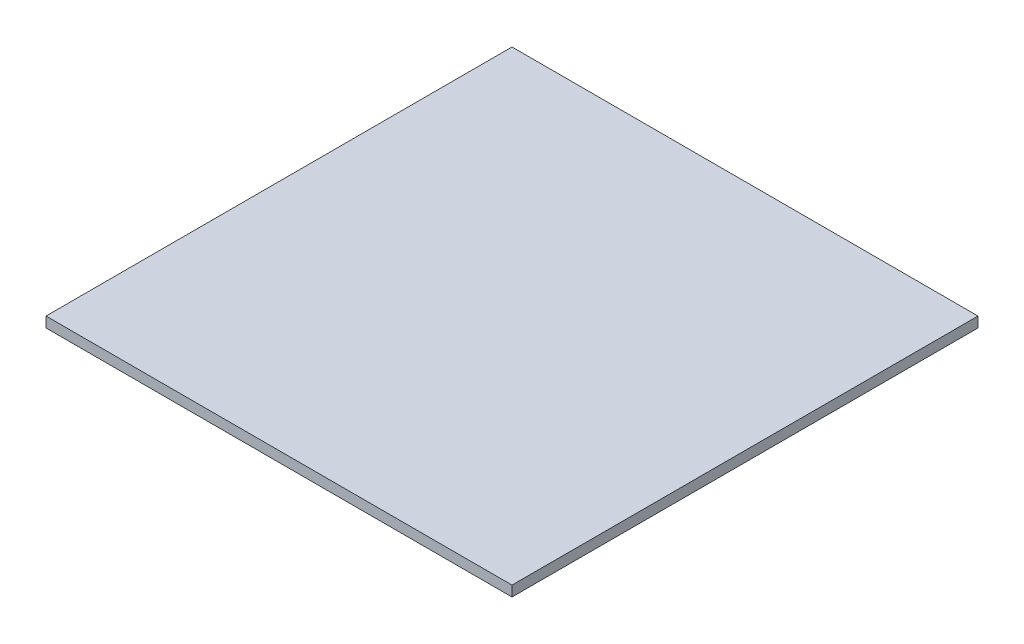
ISO-10303-21;
HEADER;
FILE_DESCRIPTION(('STEP AP214'),'2;1');
FILE_NAME('part.step','',(''),(''),'','','');
FILE_SCHEMA(('AUTOMOTIVE_DESIGN { 1 0 10303 214 1 1 1 1 }'));
ENDSEC;
DATA;
#1=APPLICATION_CONTEXT('core data for automotive mechanical design processes');
#2=APPLICATION_PROTOCOL_DEFINITION('international standard','automotive_design',2000,#1);
#3=PRODUCT_CONTEXT('',#1,'mechanical');
#4=PRODUCT('Part','Part','',(#3));
#5=PRODUCT_RELATED_PRODUCT_CATEGORY('part','',(#4));
#6=PRODUCT_DEFINITION_FORMATION('','',#4);
#7=PRODUCT_DEFINITION_CONTEXT('part definition',#1,'design');
#8=PRODUCT_DEFINITION('design','',#6,#7);
#9=PRODUCT_DEFINITION_SHAPE('','',#8);
#10=(LENGTH_UNIT() NAMED_UNIT(*) SI_UNIT(.MILLI.,.METRE.));
#11=(NAMED_UNIT(*) PLANE_ANGLE_UNIT() SI_UNIT($,.RADIAN.));
#12=(NAMED_UNIT(*) SI_UNIT($,.STERADIAN.) SOLID_ANGLE_UNIT());
#13=UNCERTAINTY_MEASURE_WITH_UNIT(LENGTH_MEASURE(1.E-05),#10,'distance_accuracy_value','');
#14=(GEOMETRIC_REPRESENTATION_CONTEXT(3) GLOBAL_UNCERTAINTY_ASSIGNED_CONTEXT((#13)) GLOBAL_UNIT_ASSIGNED_CONTEXT((#10,
#11,#12)) REPRESENTATION_CONTEXT('',''));
#15=CARTESIAN_POINT('',(0.,0.,0.));
#16=DIRECTION('',(0.,0.,1.));
#17=DIRECTION('',(1.,0.,0.));
#18=AXIS2_PLACEMENT_3D('',#15,#16,#17);
#19=CARTESIAN_POINT('',(225.,10.,225.));
#20=DIRECTION('',(-1.,0.,0.));
#21=DIRECTION('',(0.,0.,1.));
#22=AXIS2_PLACEMENT_3D('',#19,#20,#21);
#23=PLANE('',#22);
#24=DIRECTION('',(0.,0.,-1.));
#25=VECTOR('',#24,1.);
#26=CARTESIAN_POINT('',(225.,0.,225.));
#27=LINE('',#26,#25);
#28=CARTESIAN_POINT('',(225.,0.,225.));
#29=VERTEX_POINT('',#28);
#30=CARTESIAN_POINT('',(225.,0.,-225.));
#31=VERTEX_POINT('',#30);
#32=EDGE_CURVE('E107',#29,#31,#27,.T.);
#33=ORIENTED_EDGE('',*,*,#32,.T.);
#34=DIRECTION('',(0.,-1.,0.));
#35=VECTOR('',#34,1.);
#36=CARTESIAN_POINT('',(225.,10.,-225.));
#37=LINE('',#36,#35);
#38=CARTESIAN_POINT('',(225.,10.,-225.));
#39=VERTEX_POINT('',#38);
#40=EDGE_CURVE('E11',#39,#31,#37,.T.);
#41=ORIENTED_EDGE('',*,*,#40,.F.);
#42=DIRECTION('',(0.,0.,-1.));
#43=VECTOR('',#42,1.);
#44=CARTESIAN_POINT('',(225.,10.,225.));
#45=LINE('',#44,#43);
#46=CARTESIAN_POINT('',(225.,10.,225.));
#47=VERTEX_POINT('',#46);
#48=EDGE_CURVE('E91',#47,#39,#45,.T.);
#49=ORIENTED_EDGE('',*,*,#48,.F.);
#50=DIRECTION('',(0.,-1.,0.));
#51=VECTOR('',#50,1.);
#52=CARTESIAN_POINT('',(225.,10.,225.));
#53=LINE('',#52,#51);
#54=EDGE_CURVE('E103',#47,#29,#53,.T.);
#55=ORIENTED_EDGE('',*,*,#54,.T.);
#56=EDGE_LOOP('',(#33,#41,#49,#55));
#57=FACE_BOUND('',#56,.T.);
#58=ADVANCED_FACE('F39',(#57),#23,.F.);
#59=CARTESIAN_POINT('',(-225.,10.,-225.));
#60=DIRECTION('',(0.,0.,1.));
#61=DIRECTION('',(1.,0.,0.));
#62=AXIS2_PLACEMENT_3D('',#59,#60,#61);
#63=PLANE('',#62);
#64=DIRECTION('',(-1.,0.,0.));
#65=VECTOR('',#64,1.);
#66=CARTESIAN_POINT('',(-225.,0.,-225.));
#67=LINE('',#66,#65);
#68=CARTESIAN_POINT('',(-225.,0.,-225.));
#69=VERTEX_POINT('',#68);
#70=EDGE_CURVE('E96',#31,#69,#67,.T.);
#71=ORIENTED_EDGE('',*,*,#70,.T.);
#72=DIRECTION('',(0.,-1.,0.));
#73=VECTOR('',#72,1.);
#74=CARTESIAN_POINT('',(-225.,10.,-225.));
#75=LINE('',#74,#73);
#76=CARTESIAN_POINT('',(-225.,10.,-225.));
#77=VERTEX_POINT('',#76);
#78=EDGE_CURVE('E48',#77,#69,#75,.T.);
#79=ORIENTED_EDGE('',*,*,#78,.F.);
#80=DIRECTION('',(-1.,0.,0.));
#81=VECTOR('',#80,1.);
#82=CARTESIAN_POINT('',(-225.,10.,-225.));
#83=LINE('',#82,#81);
#84=EDGE_CURVE('E86',#39,#77,#83,.T.);
#85=ORIENTED_EDGE('',*,*,#84,.F.);
#86=ORIENTED_EDGE('',*,*,#40,.T.);
#87=EDGE_LOOP('',(#71,#79,#85,#86));
#88=FACE_BOUND('',#87,.T.);
#89=ADVANCED_FACE('F95',(#88),#63,.F.);
#90=CARTESIAN_POINT('',(-225.,10.,225.));
#91=DIRECTION('',(1.,0.,0.));
#92=DIRECTION('',(0.,0.,-1.));
#93=AXIS2_PLACEMENT_3D('',#90,#91,#92);
#94=PLANE('',#93);
#95=DIRECTION('',(0.,0.,1.));
#96=VECTOR('',#95,1.);
#97=CARTESIAN_POINT('',(-225.,0.,225.));
#98=LINE('',#97,#96);
#99=CARTESIAN_POINT('',(-225.,0.,225.));
#100=VERTEX_POINT('',#99);
#101=EDGE_CURVE('E73',#69,#100,#98,.T.);
#102=ORIENTED_EDGE('',*,*,#101,.T.);
#103=DIRECTION('',(0.,-1.,0.));
#104=VECTOR('',#103,1.);
#105=CARTESIAN_POINT('',(-225.,10.,225.));
#106=LINE('',#105,#104);
#107=CARTESIAN_POINT('',(-225.,10.,225.));
#108=VERTEX_POINT('',#107);
#109=EDGE_CURVE('E98',#108,#100,#106,.T.);
#110=ORIENTED_EDGE('',*,*,#109,.F.);
#111=DIRECTION('',(0.,0.,1.));
#112=VECTOR('',#111,1.);
#113=CARTESIAN_POINT('',(-225.,10.,225.));
#114=LINE('',#113,#112);
#115=EDGE_CURVE('E89',#77,#108,#114,.T.);
#116=ORIENTED_EDGE('',*,*,#115,.F.);
#117=ORIENTED_EDGE('',*,*,#78,.T.);
#118=EDGE_LOOP('',(#102,#110,#116,#117));
#119=FACE_BOUND('',#118,.T.);
#120=ADVANCED_FACE('F99',(#119),#94,.F.);
#121=CARTESIAN_POINT('',(-225.,10.,225.));
#122=DIRECTION('',(0.,0.,-1.));
#123=DIRECTION('',(-1.,0.,0.));
#124=AXIS2_PLACEMENT_3D('',#121,#122,#123);
#125=PLANE('',#124);
#126=DIRECTION('',(1.,0.,0.));
#127=VECTOR('',#126,1.);
#128=CARTESIAN_POINT('',(-225.,0.,225.));
#129=LINE('',#128,#127);
#130=EDGE_CURVE('E79',#100,#29,#129,.T.);
#131=ORIENTED_EDGE('',*,*,#130,.T.);
#132=ORIENTED_EDGE('',*,*,#54,.F.);
#133=DIRECTION('',(1.,0.,0.));
#134=VECTOR('',#133,1.);
#135=CARTESIAN_POINT('',(-225.,10.,225.));
#136=LINE('',#135,#134);
#137=EDGE_CURVE('E56',#108,#47,#136,.T.);
#138=ORIENTED_EDGE('',*,*,#137,.F.);
#139=ORIENTED_EDGE('',*,*,#109,.T.);
#140=EDGE_LOOP('',(#131,#132,#138,#139));
#141=FACE_BOUND('',#140,.T.);
#142=ADVANCED_FACE('F120',(#141),#125,.F.);
#143=CARTESIAN_POINT('',(0.,10.,0.));
#144=DIRECTION('',(0.,-1.,0.));
#145=DIRECTION('',(0.,0.,-1.));
#146=AXIS2_PLACEMENT_3D('',#143,#144,#145);
#147=PLANE('',#146);
#148=ORIENTED_EDGE('',*,*,#48,.T.);
#149=ORIENTED_EDGE('',*,*,#84,.T.);
#150=ORIENTED_EDGE('',*,*,#115,.T.);
#151=ORIENTED_EDGE('',*,*,#137,.T.);
#152=EDGE_LOOP('',(#148,#149,#150,#151));
#153=FACE_BOUND('',#152,.T.);
#154=ADVANCED_FACE('F87',(#153),#147,.F.);
#155=CARTESIAN_POINT('',(0.,0.,0.));
#156=DIRECTION('',(0.,-1.,0.));
#157=DIRECTION('',(0.,0.,-1.));
#158=AXIS2_PLACEMENT_3D('',#155,#156,#157);
#159=PLANE('',#158);
#160=ORIENTED_EDGE('',*,*,#32,.F.);
#161=ORIENTED_EDGE('',*,*,#130,.F.);
#162=ORIENTED_EDGE('',*,*,#101,.F.);
#163=ORIENTED_EDGE('',*,*,#70,.F.);
#164=EDGE_LOOP('',(#160,#161,#162,#163));
#165=FACE_BOUND('',#164,.T.);
#166=ADVANCED_FACE('F123',(#165),#159,.T.);
#167=CLOSED_SHELL('',(#58,#89,#120,#142,#154,#166));
#168=MANIFOLD_SOLID_BREP('B2',#167);
#169=ADVANCED_BREP_SHAPE_REPRESENTATION('',(#18,#168),#14);
#170=SHAPE_DEFINITION_REPRESENTATION(#9,#169);
ENDSEC;
END-ISO-10303-21;
